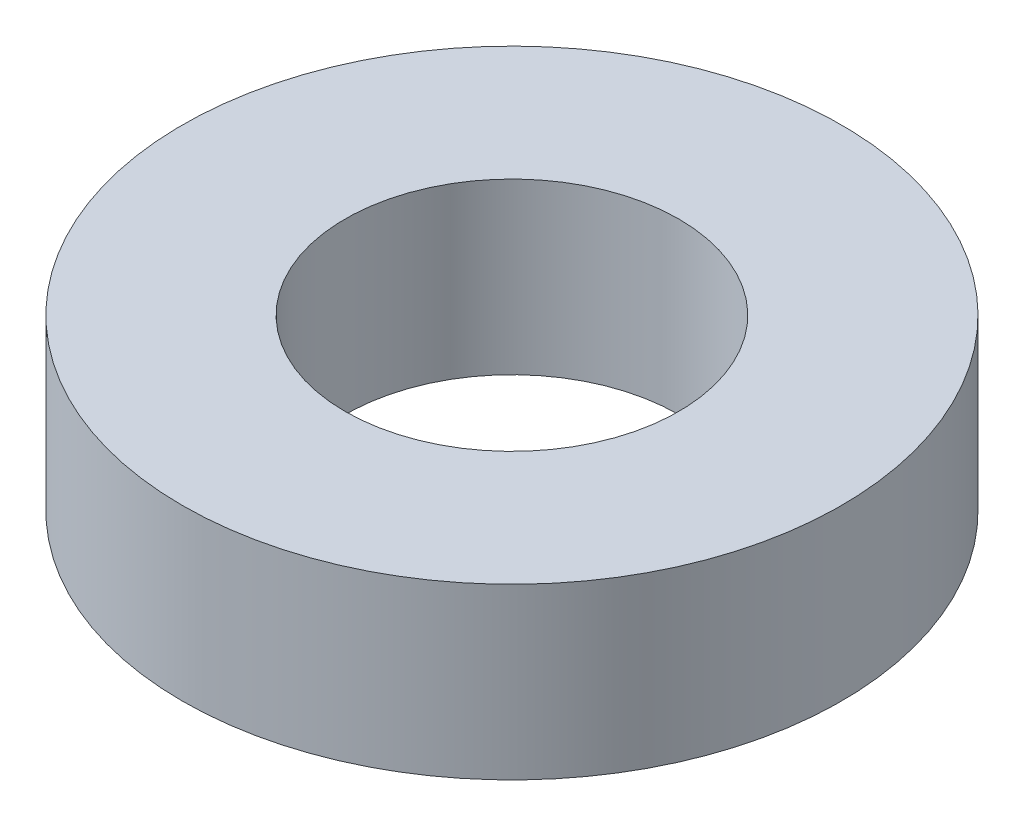
ISO-10303-21;
HEADER;
FILE_DESCRIPTION(('STEP AP214'),'2;1');
FILE_NAME('part.step','',(''),(''),'','','');
FILE_SCHEMA(('AUTOMOTIVE_DESIGN { 1 0 10303 214 1 1 1 1 }'));
ENDSEC;
DATA;
#1=APPLICATION_CONTEXT('core data for automotive mechanical design processes');
#2=APPLICATION_PROTOCOL_DEFINITION('international standard','automotive_design',2000,#1);
#3=PRODUCT_CONTEXT('',#1,'mechanical');
#4=PRODUCT('Part','Part','',(#3));
#5=PRODUCT_RELATED_PRODUCT_CATEGORY('part','',(#4));
#6=PRODUCT_DEFINITION_FORMATION('','',#4);
#7=PRODUCT_DEFINITION_CONTEXT('part definition',#1,'design');
#8=PRODUCT_DEFINITION('design','',#6,#7);
#9=PRODUCT_DEFINITION_SHAPE('','',#8);
#10=(LENGTH_UNIT() NAMED_UNIT(*) SI_UNIT(.MILLI.,.METRE.));
#11=(NAMED_UNIT(*) PLANE_ANGLE_UNIT() SI_UNIT($,.RADIAN.));
#12=(NAMED_UNIT(*) SI_UNIT($,.STERADIAN.) SOLID_ANGLE_UNIT());
#13=UNCERTAINTY_MEASURE_WITH_UNIT(LENGTH_MEASURE(1.E-05),#10,'distance_accuracy_value','');
#14=(GEOMETRIC_REPRESENTATION_CONTEXT(3) GLOBAL_UNCERTAINTY_ASSIGNED_CONTEXT((#13)) GLOBAL_UNIT_ASSIGNED_CONTEXT((#10,
#11,#12)) REPRESENTATION_CONTEXT('',''));
#15=CARTESIAN_POINT('',(0.,0.,0.));
#16=DIRECTION('',(0.,0.,1.));
#17=DIRECTION('',(1.,0.,0.));
#18=AXIS2_PLACEMENT_3D('',#15,#16,#17);
#19=CARTESIAN_POINT('',(0.,-12.7,0.));
#20=DIRECTION('',(0.,1.,0.));
#21=DIRECTION('',(0.,0.,1.));
#22=AXIS2_PLACEMENT_3D('',#19,#20,#21);
#23=CYLINDRICAL_SURFACE('',#22,24.7);
#24=CARTESIAN_POINT('',(0.,-12.7,0.));
#25=DIRECTION('',(0.,1.,0.));
#26=DIRECTION('',(0.,0.,1.));
#27=AXIS2_PLACEMENT_3D('',#24,#25,#26);
#28=CIRCLE('',#27,24.7);
#29=CARTESIAN_POINT('',(0.,-12.7,24.7));
#30=VERTEX_POINT('',#29);
#31=EDGE_CURVE('E10',#30,#30,#28,.T.);
#32=ORIENTED_EDGE('',*,*,#31,.T.);
#33=EDGE_LOOP('',(#32));
#34=FACE_BOUND('',#33,.T.);
#35=CARTESIAN_POINT('',(0.,0.,0.));
#36=DIRECTION('',(0.,1.,0.));
#37=DIRECTION('',(0.,0.,1.));
#38=AXIS2_PLACEMENT_3D('',#35,#36,#37);
#39=CIRCLE('',#38,24.7);
#40=CARTESIAN_POINT('',(0.,0.,24.7));
#41=VERTEX_POINT('',#40);
#42=EDGE_CURVE('E40',#41,#41,#39,.T.);
#43=ORIENTED_EDGE('',*,*,#42,.F.);
#44=EDGE_LOOP('',(#43));
#45=FACE_BOUND('',#44,.T.);
#46=ADVANCED_FACE('F37',(#34,#45),#23,.T.);
#47=CARTESIAN_POINT('',(0.,-12.7,0.));
#48=DIRECTION('',(0.,1.,0.));
#49=DIRECTION('',(0.,0.,1.));
#50=AXIS2_PLACEMENT_3D('',#47,#48,#49);
#51=PLANE('',#50);
#52=CARTESIAN_POINT('',(0.,-12.7,0.));
#53=DIRECTION('',(0.,1.,0.));
#54=DIRECTION('',(0.,0.,1.));
#55=AXIS2_PLACEMENT_3D('',#52,#53,#54);
#56=CIRCLE('',#55,12.5);
#57=CARTESIAN_POINT('',(0.,-12.7,12.5));
#58=VERTEX_POINT('',#57);
#59=EDGE_CURVE('E49',#58,#58,#56,.T.);
#60=ORIENTED_EDGE('',*,*,#59,.T.);
#61=EDGE_LOOP('',(#60));
#62=FACE_BOUND('',#61,.T.);
#63=ORIENTED_EDGE('',*,*,#31,.F.);
#64=EDGE_LOOP('',(#63));
#65=FACE_BOUND('',#64,.T.);
#66=ADVANCED_FACE('F59',(#62,#65),#51,.F.);
#67=CARTESIAN_POINT('',(0.,0.,0.));
#68=DIRECTION('',(0.,1.,0.));
#69=DIRECTION('',(0.,0.,1.));
#70=AXIS2_PLACEMENT_3D('',#67,#68,#69);
#71=PLANE('',#70);
#72=CARTESIAN_POINT('',(0.,0.,0.));
#73=DIRECTION('',(0.,1.,0.));
#74=DIRECTION('',(0.,0.,1.));
#75=AXIS2_PLACEMENT_3D('',#72,#73,#74);
#76=CIRCLE('',#75,12.5);
#77=CARTESIAN_POINT('',(0.,0.,12.5));
#78=VERTEX_POINT('',#77);
#79=EDGE_CURVE('E51',#78,#78,#76,.T.);
#80=ORIENTED_EDGE('',*,*,#79,.F.);
#81=EDGE_LOOP('',(#80));
#82=FACE_BOUND('',#81,.T.);
#83=ORIENTED_EDGE('',*,*,#42,.T.);
#84=EDGE_LOOP('',(#83));
#85=FACE_BOUND('',#84,.T.);
#86=ADVANCED_FACE('F65',(#82,#85),#71,.T.);
#87=CARTESIAN_POINT('',(0.,-12.7,0.));
#88=DIRECTION('',(0.,1.,0.));
#89=DIRECTION('',(0.,0.,1.));
#90=AXIS2_PLACEMENT_3D('',#87,#88,#89);
#91=CYLINDRICAL_SURFACE('',#90,12.5);
#92=ORIENTED_EDGE('',*,*,#59,.F.);
#93=EDGE_LOOP('',(#92));
#94=FACE_BOUND('',#93,.T.);
#95=ORIENTED_EDGE('',*,*,#79,.T.);
#96=EDGE_LOOP('',(#95));
#97=FACE_BOUND('',#96,.T.);
#98=ADVANCED_FACE('F62',(#94,#97),#91,.F.);
#99=CLOSED_SHELL('',(#46,#66,#86,#98));
#100=MANIFOLD_SOLID_BREP('B2',#99);
#101=ADVANCED_BREP_SHAPE_REPRESENTATION('',(#18,#100),#14);
#102=SHAPE_DEFINITION_REPRESENTATION(#9,#101);
ENDSEC;
END-ISO-10303-21;
